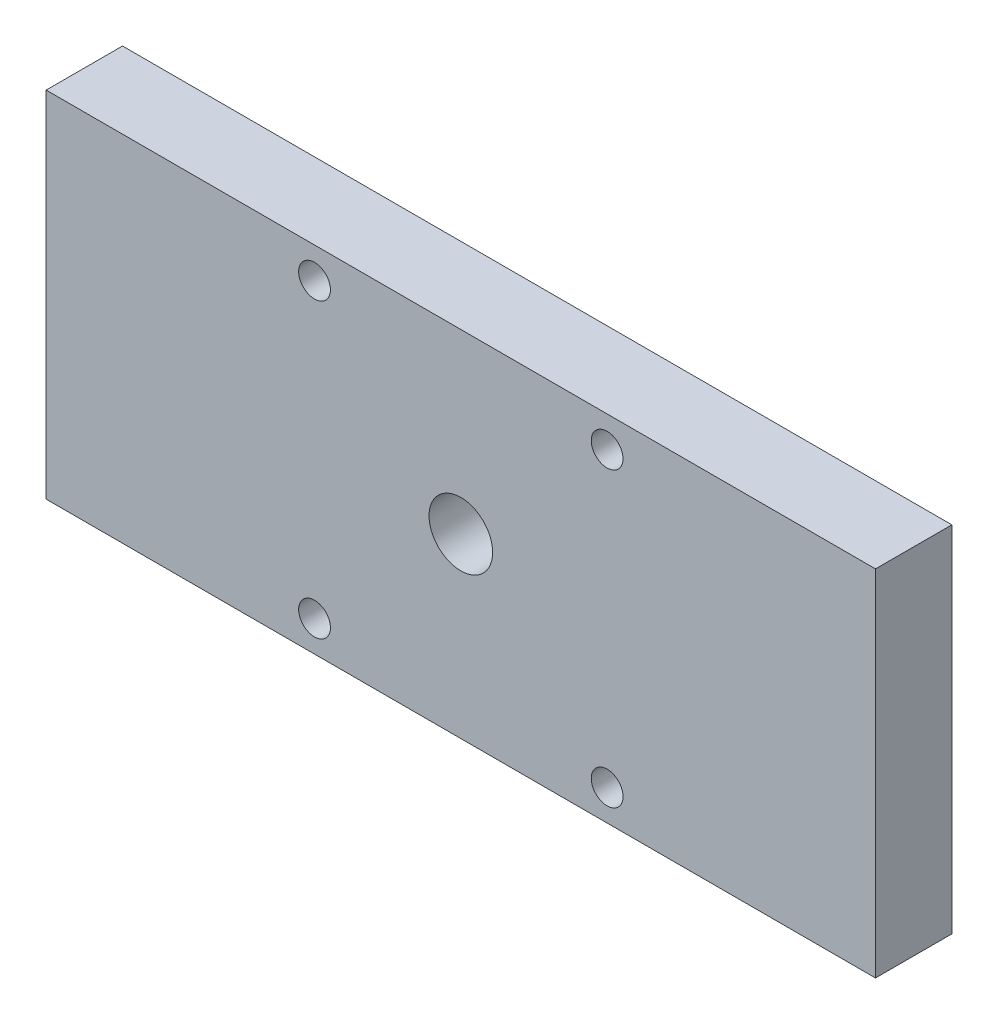
ISO-10303-21;
HEADER;
FILE_DESCRIPTION(('STEP AP214'),'2;1');
FILE_NAME('part.step','',(''),(''),'','','');
FILE_SCHEMA(('AUTOMOTIVE_DESIGN { 1 0 10303 214 1 1 1 1 }'));
ENDSEC;
DATA;
#1=APPLICATION_CONTEXT('core data for automotive mechanical design processes');
#2=APPLICATION_PROTOCOL_DEFINITION('international standard','automotive_design',2000,#1);
#3=PRODUCT_CONTEXT('',#1,'mechanical');
#4=PRODUCT('Part','Part','',(#3));
#5=PRODUCT_RELATED_PRODUCT_CATEGORY('part','',(#4));
#6=PRODUCT_DEFINITION_FORMATION('','',#4);
#7=PRODUCT_DEFINITION_CONTEXT('part definition',#1,'design');
#8=PRODUCT_DEFINITION('design','',#6,#7);
#9=PRODUCT_DEFINITION_SHAPE('','',#8);
#10=(LENGTH_UNIT() NAMED_UNIT(*) SI_UNIT(.MILLI.,.METRE.));
#11=(NAMED_UNIT(*) PLANE_ANGLE_UNIT() SI_UNIT($,.RADIAN.));
#12=(NAMED_UNIT(*) SI_UNIT($,.STERADIAN.) SOLID_ANGLE_UNIT());
#13=UNCERTAINTY_MEASURE_WITH_UNIT(LENGTH_MEASURE(1.E-05),#10,'distance_accuracy_value','');
#14=(GEOMETRIC_REPRESENTATION_CONTEXT(3) GLOBAL_UNCERTAINTY_ASSIGNED_CONTEXT((#13)) GLOBAL_UNIT_ASSIGNED_CONTEXT((#10,
#11,#12)) REPRESENTATION_CONTEXT('',''));
#15=CARTESIAN_POINT('',(0.,0.,0.));
#16=DIRECTION('',(0.,0.,1.));
#17=DIRECTION('',(1.,0.,0.));
#18=AXIS2_PLACEMENT_3D('',#15,#16,#17);
#19=CARTESIAN_POINT('',(-22.7281609195402,13.3647988505747,6.));
#20=DIRECTION('',(1.,0.,0.));
#21=DIRECTION('',(0.,0.,-1.));
#22=AXIS2_PLACEMENT_3D('',#19,#20,#21);
#23=PLANE('',#22);
#24=DIRECTION('',(0.,-1.,0.));
#25=VECTOR('',#24,1.);
#26=CARTESIAN_POINT('',(-22.7281609195402,13.3647988505747,0.));
#27=LINE('',#26,#25);
#28=CARTESIAN_POINT('',(-22.7281609195402,13.3647988505747,0.));
#29=VERTEX_POINT('',#28);
#30=CARTESIAN_POINT('',(-22.7281609195402,-14.4852011494253,0.));
#31=VERTEX_POINT('',#30);
#32=EDGE_CURVE('E98',#29,#31,#27,.T.);
#33=ORIENTED_EDGE('',*,*,#32,.T.);
#34=DIRECTION('',(0.,0.,-1.));
#35=VECTOR('',#34,1.);
#36=CARTESIAN_POINT('',(-22.7281609195402,-14.4852011494253,6.));
#37=LINE('',#36,#35);
#38=CARTESIAN_POINT('',(-22.7281609195402,-14.4852011494253,6.));
#39=VERTEX_POINT('',#38);
#40=EDGE_CURVE('E11',#39,#31,#37,.T.);
#41=ORIENTED_EDGE('',*,*,#40,.F.);
#42=DIRECTION('',(0.,-1.,0.));
#43=VECTOR('',#42,1.);
#44=CARTESIAN_POINT('',(-22.7281609195402,13.3647988505747,6.));
#45=LINE('',#44,#43);
#46=CARTESIAN_POINT('',(-22.7281609195402,13.3647988505747,6.));
#47=VERTEX_POINT('',#46);
#48=EDGE_CURVE('E86',#47,#39,#45,.T.);
#49=ORIENTED_EDGE('',*,*,#48,.F.);
#50=DIRECTION('',(0.,0.,-1.));
#51=VECTOR('',#50,1.);
#52=CARTESIAN_POINT('',(-22.7281609195402,13.3647988505747,6.));
#53=LINE('',#52,#51);
#54=EDGE_CURVE('E94',#47,#29,#53,.T.);
#55=ORIENTED_EDGE('',*,*,#54,.T.);
#56=EDGE_LOOP('',(#33,#41,#49,#55));
#57=FACE_BOUND('',#56,.T.);
#58=ADVANCED_FACE('F35',(#57),#23,.F.);
#59=CARTESIAN_POINT('',(-22.7281609195402,-14.4852011494253,6.));
#60=DIRECTION('',(0.,1.,0.));
#61=DIRECTION('',(0.,0.,1.));
#62=AXIS2_PLACEMENT_3D('',#59,#60,#61);
#63=PLANE('',#62);
#64=DIRECTION('',(1.,0.,0.));
#65=VECTOR('',#64,1.);
#66=CARTESIAN_POINT('',(-22.7281609195402,-14.4852011494253,0.));
#67=LINE('',#66,#65);
#68=CARTESIAN_POINT('',(42.4618390804598,-14.4852011494253,0.));
#69=VERTEX_POINT('',#68);
#70=EDGE_CURVE('E90',#31,#69,#67,.T.);
#71=ORIENTED_EDGE('',*,*,#70,.T.);
#72=DIRECTION('',(0.,0.,-1.));
#73=VECTOR('',#72,1.);
#74=CARTESIAN_POINT('',(42.4618390804598,-14.4852011494253,6.));
#75=LINE('',#74,#73);
#76=CARTESIAN_POINT('',(42.4618390804598,-14.4852011494253,6.));
#77=VERTEX_POINT('',#76);
#78=EDGE_CURVE('E43',#77,#69,#75,.T.);
#79=ORIENTED_EDGE('',*,*,#78,.F.);
#80=DIRECTION('',(1.,0.,0.));
#81=VECTOR('',#80,1.);
#82=CARTESIAN_POINT('',(-22.7281609195402,-14.4852011494253,6.));
#83=LINE('',#82,#81);
#84=EDGE_CURVE('E81',#39,#77,#83,.T.);
#85=ORIENTED_EDGE('',*,*,#84,.F.);
#86=ORIENTED_EDGE('',*,*,#40,.T.);
#87=EDGE_LOOP('',(#71,#79,#85,#86));
#88=FACE_BOUND('',#87,.T.);
#89=ADVANCED_FACE('F89',(#88),#63,.F.);
#90=CARTESIAN_POINT('',(42.4618390804598,13.3647988505747,6.));
#91=DIRECTION('',(-1.,0.,0.));
#92=DIRECTION('',(0.,0.,1.));
#93=AXIS2_PLACEMENT_3D('',#90,#91,#92);
#94=PLANE('',#93);
#95=DIRECTION('',(0.,1.,0.));
#96=VECTOR('',#95,1.);
#97=CARTESIAN_POINT('',(42.4618390804598,13.3647988505747,0.));
#98=LINE('',#97,#96);
#99=CARTESIAN_POINT('',(42.4618390804598,13.3647988505747,0.));
#100=VERTEX_POINT('',#99);
#101=EDGE_CURVE('E68',#69,#100,#98,.T.);
#102=ORIENTED_EDGE('',*,*,#101,.T.);
#103=DIRECTION('',(0.,0.,-1.));
#104=VECTOR('',#103,1.);
#105=CARTESIAN_POINT('',(42.4618390804598,13.3647988505747,6.));
#106=LINE('',#105,#104);
#107=CARTESIAN_POINT('',(42.4618390804598,13.3647988505747,6.));
#108=VERTEX_POINT('',#107);
#109=EDGE_CURVE('E91',#108,#100,#106,.T.);
#110=ORIENTED_EDGE('',*,*,#109,.F.);
#111=DIRECTION('',(0.,1.,0.));
#112=VECTOR('',#111,1.);
#113=CARTESIAN_POINT('',(42.4618390804598,13.3647988505747,6.));
#114=LINE('',#113,#112);
#115=EDGE_CURVE('E84',#77,#108,#114,.T.);
#116=ORIENTED_EDGE('',*,*,#115,.F.);
#117=ORIENTED_EDGE('',*,*,#78,.T.);
#118=EDGE_LOOP('',(#102,#110,#116,#117));
#119=FACE_BOUND('',#118,.T.);
#120=ADVANCED_FACE('F92',(#119),#94,.F.);
#121=CARTESIAN_POINT('',(-22.7281609195402,13.3647988505747,6.));
#122=DIRECTION('',(0.,-1.,0.));
#123=DIRECTION('',(0.,0.,-1.));
#124=AXIS2_PLACEMENT_3D('',#121,#122,#123);
#125=PLANE('',#124);
#126=DIRECTION('',(-1.,0.,0.));
#127=VECTOR('',#126,1.);
#128=CARTESIAN_POINT('',(-22.7281609195402,13.3647988505747,0.));
#129=LINE('',#128,#127);
#130=EDGE_CURVE('E74',#100,#29,#129,.T.);
#131=ORIENTED_EDGE('',*,*,#130,.T.);
#132=ORIENTED_EDGE('',*,*,#54,.F.);
#133=DIRECTION('',(-1.,0.,0.));
#134=VECTOR('',#133,1.);
#135=CARTESIAN_POINT('',(-22.7281609195402,13.3647988505747,6.));
#136=LINE('',#135,#134);
#137=EDGE_CURVE('E51',#108,#47,#136,.T.);
#138=ORIENTED_EDGE('',*,*,#137,.F.);
#139=ORIENTED_EDGE('',*,*,#109,.T.);
#140=EDGE_LOOP('',(#131,#132,#138,#139));
#141=FACE_BOUND('',#140,.T.);
#142=ADVANCED_FACE('F106',(#141),#125,.F.);
#143=CARTESIAN_POINT('',(0.,0.,6.));
#144=DIRECTION('',(0.,0.,1.));
#145=DIRECTION('',(1.,0.,0.));
#146=AXIS2_PLACEMENT_3D('',#143,#144,#145);
#147=PLANE('',#146);
#148=CARTESIAN_POINT('',(-1.63316091954023,-12.0652011494253,6.));
#149=DIRECTION('',(0.,0.,1.));
#150=DIRECTION('',(1.,0.,0.));
#151=AXIS2_PLACEMENT_3D('',#148,#149,#150);
#152=CIRCLE('',#151,1.25);
#153=CARTESIAN_POINT('',(-0.383160919540232,-12.0652011494253,6.));
#154=VERTEX_POINT('',#153);
#155=EDGE_CURVE('E136',#154,#154,#152,.T.);
#156=ORIENTED_EDGE('',*,*,#155,.F.);
#157=EDGE_LOOP('',(#156));
#158=FACE_BOUND('',#157,.T.);
#159=CARTESIAN_POINT('',(21.3668390804598,-12.0652011494253,6.));
#160=DIRECTION('',(0.,0.,1.));
#161=DIRECTION('',(1.,0.,0.));
#162=AXIS2_PLACEMENT_3D('',#159,#160,#161);
#163=CIRCLE('',#162,1.25);
#164=CARTESIAN_POINT('',(22.6168390804598,-12.0652011494253,6.));
#165=VERTEX_POINT('',#164);
#166=EDGE_CURVE('E130',#165,#165,#163,.T.);
#167=ORIENTED_EDGE('',*,*,#166,.F.);
#168=EDGE_LOOP('',(#167));
#169=FACE_BOUND('',#168,.T.);
#170=CARTESIAN_POINT('',(21.3668390804598,10.9347988505747,6.));
#171=DIRECTION('',(0.,0.,1.));
#172=DIRECTION('',(1.,0.,0.));
#173=AXIS2_PLACEMENT_3D('',#170,#171,#172);
#174=CIRCLE('',#173,1.25);
#175=CARTESIAN_POINT('',(22.6168390804598,10.9347988505747,6.));
#176=VERTEX_POINT('',#175);
#177=EDGE_CURVE('E124',#176,#176,#174,.T.);
#178=ORIENTED_EDGE('',*,*,#177,.F.);
#179=EDGE_LOOP('',(#178));
#180=FACE_BOUND('',#179,.T.);
#181=CARTESIAN_POINT('',(-1.63316091954024,10.9347988505747,6.));
#182=DIRECTION('',(0.,0.,1.));
#183=DIRECTION('',(1.,0.,0.));
#184=AXIS2_PLACEMENT_3D('',#181,#182,#183);
#185=CIRCLE('',#184,1.25);
#186=CARTESIAN_POINT('',(-0.383160919540235,10.9347988505747,6.));
#187=VERTEX_POINT('',#186);
#188=EDGE_CURVE('E118',#187,#187,#185,.T.);
#189=ORIENTED_EDGE('',*,*,#188,.F.);
#190=EDGE_LOOP('',(#189));
#191=FACE_BOUND('',#190,.T.);
#192=CARTESIAN_POINT('',(9.86683908045977,-0.565201149425284,6.));
#193=DIRECTION('',(0.,0.,1.));
#194=DIRECTION('',(1.,0.,0.));
#195=AXIS2_PLACEMENT_3D('',#192,#193,#194);
#196=CIRCLE('',#195,2.5);
#197=CARTESIAN_POINT('',(12.3668390804598,-0.565201149425284,6.));
#198=VERTEX_POINT('',#197);
#199=EDGE_CURVE('E112',#198,#198,#196,.T.);
#200=ORIENTED_EDGE('',*,*,#199,.F.);
#201=EDGE_LOOP('',(#200));
#202=FACE_BOUND('',#201,.T.);
#203=ORIENTED_EDGE('',*,*,#48,.T.);
#204=ORIENTED_EDGE('',*,*,#84,.T.);
#205=ORIENTED_EDGE('',*,*,#115,.T.);
#206=ORIENTED_EDGE('',*,*,#137,.T.);
#207=EDGE_LOOP('',(#203,#204,#205,#206));
#208=FACE_BOUND('',#207,.T.);
#209=ADVANCED_FACE('F82',(#158,#169,#180,#191,#202,#208),#147,.T.);
#210=CARTESIAN_POINT('',(0.,0.,0.));
#211=DIRECTION('',(0.,0.,1.));
#212=DIRECTION('',(1.,0.,0.));
#213=AXIS2_PLACEMENT_3D('',#210,#211,#212);
#214=PLANE('',#213);
#215=CARTESIAN_POINT('',(-1.63316091954023,-12.0652011494253,0.));
#216=DIRECTION('',(0.,0.,1.));
#217=DIRECTION('',(1.,0.,0.));
#218=AXIS2_PLACEMENT_3D('',#215,#216,#217);
#219=CIRCLE('',#218,1.25);
#220=CARTESIAN_POINT('',(-0.383160919540232,-12.0652011494253,0.));
#221=VERTEX_POINT('',#220);
#222=EDGE_CURVE('E133',#221,#221,#219,.T.);
#223=ORIENTED_EDGE('',*,*,#222,.T.);
#224=EDGE_LOOP('',(#223));
#225=FACE_BOUND('',#224,.T.);
#226=CARTESIAN_POINT('',(21.3668390804598,-12.0652011494253,0.));
#227=DIRECTION('',(0.,0.,1.));
#228=DIRECTION('',(1.,0.,0.));
#229=AXIS2_PLACEMENT_3D('',#226,#227,#228);
#230=CIRCLE('',#229,1.25);
#231=CARTESIAN_POINT('',(22.6168390804598,-12.0652011494253,0.));
#232=VERTEX_POINT('',#231);
#233=EDGE_CURVE('E127',#232,#232,#230,.T.);
#234=ORIENTED_EDGE('',*,*,#233,.T.);
#235=EDGE_LOOP('',(#234));
#236=FACE_BOUND('',#235,.T.);
#237=CARTESIAN_POINT('',(21.3668390804598,10.9347988505747,0.));
#238=DIRECTION('',(0.,0.,1.));
#239=DIRECTION('',(1.,0.,0.));
#240=AXIS2_PLACEMENT_3D('',#237,#238,#239);
#241=CIRCLE('',#240,1.25);
#242=CARTESIAN_POINT('',(22.6168390804598,10.9347988505747,0.));
#243=VERTEX_POINT('',#242);
#244=EDGE_CURVE('E121',#243,#243,#241,.T.);
#245=ORIENTED_EDGE('',*,*,#244,.T.);
#246=EDGE_LOOP('',(#245));
#247=FACE_BOUND('',#246,.T.);
#248=CARTESIAN_POINT('',(-1.63316091954024,10.9347988505747,0.));
#249=DIRECTION('',(0.,0.,1.));
#250=DIRECTION('',(1.,0.,0.));
#251=AXIS2_PLACEMENT_3D('',#248,#249,#250);
#252=CIRCLE('',#251,1.25);
#253=CARTESIAN_POINT('',(-0.383160919540235,10.9347988505747,0.));
#254=VERTEX_POINT('',#253);
#255=EDGE_CURVE('E115',#254,#254,#252,.T.);
#256=ORIENTED_EDGE('',*,*,#255,.T.);
#257=EDGE_LOOP('',(#256));
#258=FACE_BOUND('',#257,.T.);
#259=CARTESIAN_POINT('',(9.86683908045977,-0.565201149425284,0.));
#260=DIRECTION('',(0.,0.,1.));
#261=DIRECTION('',(1.,0.,0.));
#262=AXIS2_PLACEMENT_3D('',#259,#260,#261);
#263=CIRCLE('',#262,2.5);
#264=CARTESIAN_POINT('',(12.3668390804598,-0.565201149425284,0.));
#265=VERTEX_POINT('',#264);
#266=EDGE_CURVE('E101',#265,#265,#263,.T.);
#267=ORIENTED_EDGE('',*,*,#266,.T.);
#268=EDGE_LOOP('',(#267));
#269=FACE_BOUND('',#268,.T.);
#270=ORIENTED_EDGE('',*,*,#32,.F.);
#271=ORIENTED_EDGE('',*,*,#130,.F.);
#272=ORIENTED_EDGE('',*,*,#101,.F.);
#273=ORIENTED_EDGE('',*,*,#70,.F.);
#274=EDGE_LOOP('',(#270,#271,#272,#273));
#275=FACE_BOUND('',#274,.T.);
#276=ADVANCED_FACE('F109',(#225,#236,#247,#258,#269,#275),#214,.F.);
#277=CARTESIAN_POINT('',(9.86683908045977,-0.565201149425284,0.));
#278=DIRECTION('',(0.,0.,1.));
#279=DIRECTION('',(1.,0.,0.));
#280=AXIS2_PLACEMENT_3D('',#277,#278,#279);
#281=CYLINDRICAL_SURFACE('',#280,2.5);
#282=ORIENTED_EDGE('',*,*,#266,.F.);
#283=EDGE_LOOP('',(#282));
#284=FACE_BOUND('',#283,.T.);
#285=ORIENTED_EDGE('',*,*,#199,.T.);
#286=EDGE_LOOP('',(#285));
#287=FACE_BOUND('',#286,.T.);
#288=ADVANCED_FACE('F162',(#284,#287),#281,.F.);
#289=CARTESIAN_POINT('',(-1.63316091954024,10.9347988505747,0.));
#290=DIRECTION('',(0.,0.,1.));
#291=DIRECTION('',(1.,0.,0.));
#292=AXIS2_PLACEMENT_3D('',#289,#290,#291);
#293=CYLINDRICAL_SURFACE('',#292,1.25);
#294=ORIENTED_EDGE('',*,*,#255,.F.);
#295=EDGE_LOOP('',(#294));
#296=FACE_BOUND('',#295,.T.);
#297=ORIENTED_EDGE('',*,*,#188,.T.);
#298=EDGE_LOOP('',(#297));
#299=FACE_BOUND('',#298,.T.);
#300=ADVANCED_FACE('F164',(#296,#299),#293,.F.);
#301=CARTESIAN_POINT('',(21.3668390804598,10.9347988505747,0.));
#302=DIRECTION('',(0.,0.,1.));
#303=DIRECTION('',(1.,0.,0.));
#304=AXIS2_PLACEMENT_3D('',#301,#302,#303);
#305=CYLINDRICAL_SURFACE('',#304,1.25);
#306=ORIENTED_EDGE('',*,*,#244,.F.);
#307=EDGE_LOOP('',(#306));
#308=FACE_BOUND('',#307,.T.);
#309=ORIENTED_EDGE('',*,*,#177,.T.);
#310=EDGE_LOOP('',(#309));
#311=FACE_BOUND('',#310,.T.);
#312=ADVANCED_FACE('F171',(#308,#311),#305,.F.);
#313=CARTESIAN_POINT('',(21.3668390804598,-12.0652011494253,0.));
#314=DIRECTION('',(0.,0.,1.));
#315=DIRECTION('',(1.,0.,0.));
#316=AXIS2_PLACEMENT_3D('',#313,#314,#315);
#317=CYLINDRICAL_SURFACE('',#316,1.25);
#318=ORIENTED_EDGE('',*,*,#233,.F.);
#319=EDGE_LOOP('',(#318));
#320=FACE_BOUND('',#319,.T.);
#321=ORIENTED_EDGE('',*,*,#166,.T.);
#322=EDGE_LOOP('',(#321));
#323=FACE_BOUND('',#322,.T.);
#324=ADVANCED_FACE('F147',(#320,#323),#317,.F.);
#325=CARTESIAN_POINT('',(-1.63316091954023,-12.0652011494253,0.));
#326=DIRECTION('',(0.,0.,1.));
#327=DIRECTION('',(1.,0.,0.));
#328=AXIS2_PLACEMENT_3D('',#325,#326,#327);
#329=CYLINDRICAL_SURFACE('',#328,1.25);
#330=ORIENTED_EDGE('',*,*,#222,.F.);
#331=EDGE_LOOP('',(#330));
#332=FACE_BOUND('',#331,.T.);
#333=ORIENTED_EDGE('',*,*,#155,.T.);
#334=EDGE_LOOP('',(#333));
#335=FACE_BOUND('',#334,.T.);
#336=ADVANCED_FACE('F144',(#332,#335),#329,.F.);
#337=CLOSED_SHELL('',(#58,#89,#120,#142,#209,#276,#288,#300,#312,#324,#336));
#338=MANIFOLD_SOLID_BREP('B2',#337);
#339=ADVANCED_BREP_SHAPE_REPRESENTATION('',(#18,#338),#14);
#340=SHAPE_DEFINITION_REPRESENTATION(#9,#339);
ENDSEC;
END-ISO-10303-21;
